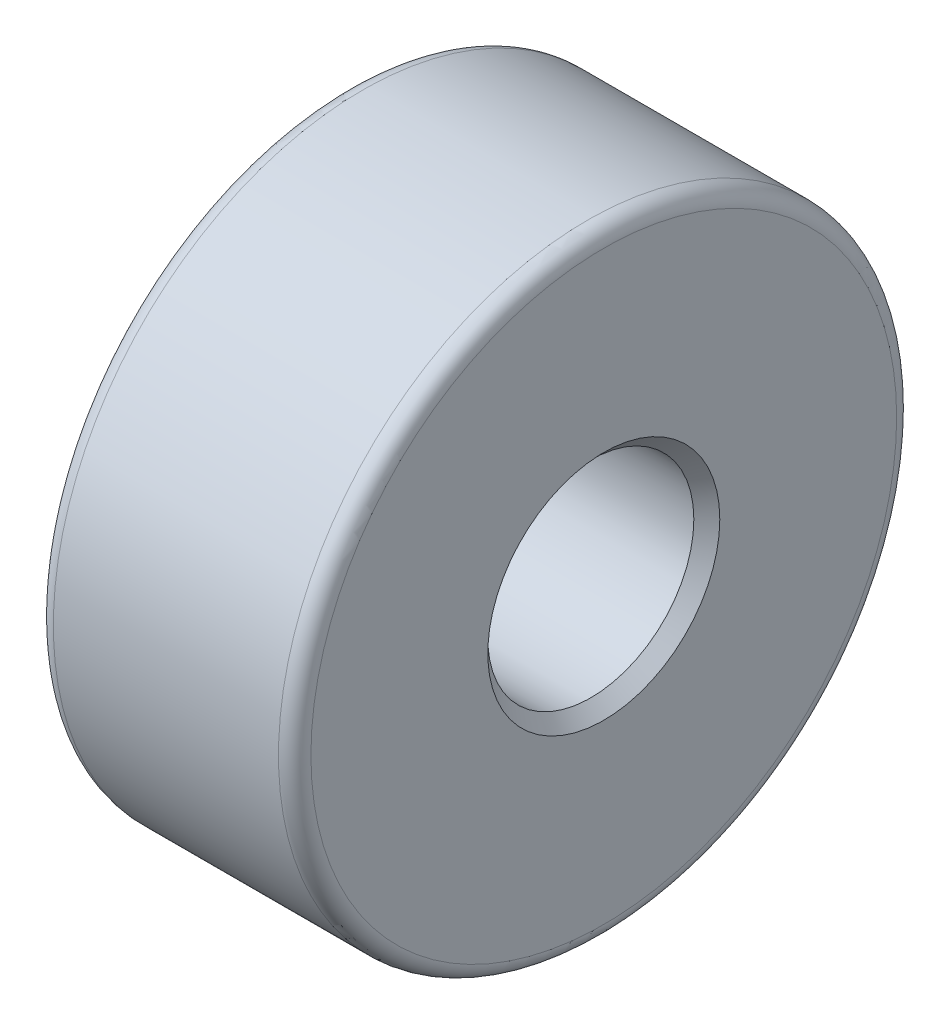
ISO-10303-21;
HEADER;
FILE_DESCRIPTION(('STEP AP214'),'2;1');
FILE_NAME('part.step','',(''),(''),'','','');
FILE_SCHEMA(('AUTOMOTIVE_DESIGN { 1 0 10303 214 1 1 1 1 }'));
ENDSEC;
DATA;
#1=APPLICATION_CONTEXT('core data for automotive mechanical design processes');
#2=APPLICATION_PROTOCOL_DEFINITION('international standard','automotive_design',2000,#1);
#3=PRODUCT_CONTEXT('',#1,'mechanical');
#4=PRODUCT('Part','Part','',(#3));
#5=PRODUCT_RELATED_PRODUCT_CATEGORY('part','',(#4));
#6=PRODUCT_DEFINITION_FORMATION('','',#4);
#7=PRODUCT_DEFINITION_CONTEXT('part definition',#1,'design');
#8=PRODUCT_DEFINITION('design','',#6,#7);
#9=PRODUCT_DEFINITION_SHAPE('','',#8);
#10=(LENGTH_UNIT() NAMED_UNIT(*) SI_UNIT(.MILLI.,.METRE.));
#11=(NAMED_UNIT(*) PLANE_ANGLE_UNIT() SI_UNIT($,.RADIAN.));
#12=(NAMED_UNIT(*) SI_UNIT($,.STERADIAN.) SOLID_ANGLE_UNIT());
#13=UNCERTAINTY_MEASURE_WITH_UNIT(LENGTH_MEASURE(1.E-05),#10,'distance_accuracy_value','');
#14=(GEOMETRIC_REPRESENTATION_CONTEXT(3) GLOBAL_UNCERTAINTY_ASSIGNED_CONTEXT((#13)) GLOBAL_UNIT_ASSIGNED_CONTEXT((#10,
#11,#12)) REPRESENTATION_CONTEXT('',''));
#15=CARTESIAN_POINT('',(0.,0.,0.));
#16=DIRECTION('',(0.,0.,1.));
#17=DIRECTION('',(1.,0.,0.));
#18=AXIS2_PLACEMENT_3D('',#15,#16,#17);
#19=CARTESIAN_POINT('',(3.96875,0.,0.));
#20=DIRECTION('',(1.,0.,0.));
#21=DIRECTION('',(0.,0.,-1.));
#22=AXIS2_PLACEMENT_3D('',#19,#20,#21);
#23=PLANE('',#22);
#24=CARTESIAN_POINT('',(3.96875,0.,0.));
#25=DIRECTION('',(1.,0.,0.));
#26=DIRECTION('',(0.,0.,-1.));
#27=AXIS2_PLACEMENT_3D('',#24,#25,#26);
#28=CIRCLE('',#27,4.5125);
#29=CARTESIAN_POINT('',(3.96875,0.,-4.5125));
#30=VERTEX_POINT('',#29);
#31=EDGE_CURVE('E55',#30,#30,#28,.T.);
#32=ORIENTED_EDGE('',*,*,#31,.T.);
#33=EDGE_LOOP('',(#32));
#34=FACE_BOUND('',#33,.T.);
#35=CARTESIAN_POINT('',(3.96875,0.,0.));
#36=DIRECTION('',(1.,0.,0.));
#37=DIRECTION('',(0.,0.,-1.));
#38=AXIS2_PLACEMENT_3D('',#35,#36,#37);
#39=CIRCLE('',#38,1.7875);
#40=CARTESIAN_POINT('',(3.96875,0.,-1.7875));
#41=VERTEX_POINT('',#40);
#42=EDGE_CURVE('E61',#41,#41,#39,.F.);
#43=ORIENTED_EDGE('',*,*,#42,.T.);
#44=EDGE_LOOP('',(#43));
#45=FACE_BOUND('',#44,.T.);
#46=ADVANCED_FACE('F37',(#34,#45),#23,.T.);
#47=CARTESIAN_POINT('',(0.,0.,0.));
#48=DIRECTION('',(1.,0.,0.));
#49=DIRECTION('',(0.,0.,-1.));
#50=AXIS2_PLACEMENT_3D('',#47,#48,#49);
#51=PLANE('',#50);
#52=CARTESIAN_POINT('',(0.,0.,0.));
#53=DIRECTION('',(1.,0.,0.));
#54=DIRECTION('',(0.,0.,-1.));
#55=AXIS2_PLACEMENT_3D('',#52,#53,#54);
#56=CIRCLE('',#55,4.5125);
#57=CARTESIAN_POINT('',(0.,0.,-4.5125));
#58=VERTEX_POINT('',#57);
#59=EDGE_CURVE('E10',#58,#58,#56,.F.);
#60=ORIENTED_EDGE('',*,*,#59,.T.);
#61=EDGE_LOOP('',(#60));
#62=FACE_BOUND('',#61,.T.);
#63=CARTESIAN_POINT('',(0.,0.,0.));
#64=DIRECTION('',(1.,0.,0.));
#65=DIRECTION('',(0.,0.,-1.));
#66=AXIS2_PLACEMENT_3D('',#63,#64,#65);
#67=CIRCLE('',#66,1.7875);
#68=CARTESIAN_POINT('',(0.,0.,-1.7875));
#69=VERTEX_POINT('',#68);
#70=EDGE_CURVE('E73',#69,#69,#67,.T.);
#71=ORIENTED_EDGE('',*,*,#70,.T.);
#72=EDGE_LOOP('',(#71));
#73=FACE_BOUND('',#72,.T.);
#74=ADVANCED_FACE('F78',(#62,#73),#51,.F.);
#75=CARTESIAN_POINT('',(3.96875,0.,0.));
#76=DIRECTION('',(-1.,0.,0.));
#77=DIRECTION('',(0.,0.,1.));
#78=AXIS2_PLACEMENT_3D('',#75,#76,#77);
#79=CYLINDRICAL_SURFACE('',#78,4.7625);
#80=CARTESIAN_POINT('',(3.71875,0.,0.));
#81=DIRECTION('',(1.,0.,0.));
#82=DIRECTION('',(0.,0.,-1.));
#83=AXIS2_PLACEMENT_3D('',#80,#81,#82);
#84=CIRCLE('',#83,4.7625);
#85=CARTESIAN_POINT('',(3.71875,0.,-4.7625));
#86=VERTEX_POINT('',#85);
#87=EDGE_CURVE('E45',#86,#86,#84,.F.);
#88=ORIENTED_EDGE('',*,*,#87,.T.);
#89=EDGE_LOOP('',(#88));
#90=FACE_BOUND('',#89,.T.);
#91=CARTESIAN_POINT('',(0.25,0.,0.));
#92=DIRECTION('',(1.,0.,0.));
#93=DIRECTION('',(0.,0.,-1.));
#94=AXIS2_PLACEMENT_3D('',#91,#92,#93);
#95=CIRCLE('',#94,4.7625);
#96=CARTESIAN_POINT('',(0.25,0.,-4.7625));
#97=VERTEX_POINT('',#96);
#98=EDGE_CURVE('E50',#97,#97,#95,.T.);
#99=ORIENTED_EDGE('',*,*,#98,.T.);
#100=EDGE_LOOP('',(#99));
#101=FACE_BOUND('',#100,.T.);
#102=ADVANCED_FACE('F93',(#90,#101),#79,.T.);
#103=CARTESIAN_POINT('',(3.96875,0.,0.));
#104=DIRECTION('',(-1.,0.,0.));
#105=DIRECTION('',(0.,0.,1.));
#106=AXIS2_PLACEMENT_3D('',#103,#104,#105);
#107=CYLINDRICAL_SURFACE('',#106,1.5875);
#108=CARTESIAN_POINT('',(0.200000000000003,0.,0.));
#109=DIRECTION('',(1.,0.,0.));
#110=DIRECTION('',(0.,0.,-1.));
#111=AXIS2_PLACEMENT_3D('',#108,#109,#110);
#112=CIRCLE('',#111,1.5875);
#113=CARTESIAN_POINT('',(0.200000000000003,0.,-1.5875));
#114=VERTEX_POINT('',#113);
#115=EDGE_CURVE('E65',#114,#114,#112,.F.);
#116=ORIENTED_EDGE('',*,*,#115,.T.);
#117=EDGE_LOOP('',(#116));
#118=FACE_BOUND('',#117,.T.);
#119=CARTESIAN_POINT('',(3.76875,0.,0.));
#120=DIRECTION('',(1.,0.,0.));
#121=DIRECTION('',(0.,0.,-1.));
#122=AXIS2_PLACEMENT_3D('',#119,#120,#121);
#123=CIRCLE('',#122,1.5875);
#124=CARTESIAN_POINT('',(3.76875,0.,-1.5875));
#125=VERTEX_POINT('',#124);
#126=EDGE_CURVE('E69',#125,#125,#123,.T.);
#127=ORIENTED_EDGE('',*,*,#126,.T.);
#128=EDGE_LOOP('',(#127));
#129=FACE_BOUND('',#128,.T.);
#130=ADVANCED_FACE('F83',(#118,#129),#107,.F.);
#131=CARTESIAN_POINT('',(0.,0.,0.));
#132=DIRECTION('',(-1.,0.,0.));
#133=DIRECTION('',(0.,0.,1.));
#134=AXIS2_PLACEMENT_3D('',#131,#132,#133);
#135=CONICAL_SURFACE('',#134,1.7875,0.785398163397443);
#136=ORIENTED_EDGE('',*,*,#115,.F.);
#137=EDGE_LOOP('',(#136));
#138=FACE_BOUND('',#137,.T.);
#139=ORIENTED_EDGE('',*,*,#70,.F.);
#140=EDGE_LOOP('',(#139));
#141=FACE_BOUND('',#140,.T.);
#142=ADVANCED_FACE('F80',(#138,#141),#135,.F.);
#143=CARTESIAN_POINT('',(3.76875,0.,0.));
#144=DIRECTION('',(1.,0.,0.));
#145=DIRECTION('',(0.,0.,-1.));
#146=AXIS2_PLACEMENT_3D('',#143,#144,#145);
#147=CONICAL_SURFACE('',#146,1.5875,0.785398163397453);
#148=ORIENTED_EDGE('',*,*,#42,.F.);
#149=EDGE_LOOP('',(#148));
#150=FACE_BOUND('',#149,.T.);
#151=ORIENTED_EDGE('',*,*,#126,.F.);
#152=EDGE_LOOP('',(#151));
#153=FACE_BOUND('',#152,.T.);
#154=ADVANCED_FACE('F82',(#150,#153),#147,.F.);
#155=CARTESIAN_POINT('',(3.71875,0.,0.));
#156=DIRECTION('',(1.,0.,0.));
#157=DIRECTION('',(0.,0.,-1.));
#158=AXIS2_PLACEMENT_3D('',#155,#156,#157);
#159=TOROIDAL_SURFACE('',#158,4.5125,0.25);
#160=ORIENTED_EDGE('',*,*,#87,.F.);
#161=EDGE_LOOP('',(#160));
#162=FACE_BOUND('',#161,.T.);
#163=ORIENTED_EDGE('',*,*,#31,.F.);
#164=EDGE_LOOP('',(#163));
#165=FACE_BOUND('',#164,.T.);
#166=ADVANCED_FACE('F90',(#162,#165),#159,.T.);
#167=CARTESIAN_POINT('',(0.25,0.,0.));
#168=DIRECTION('',(1.,0.,0.));
#169=DIRECTION('',(0.,0.,-1.));
#170=AXIS2_PLACEMENT_3D('',#167,#168,#169);
#171=TOROIDAL_SURFACE('',#170,4.5125,0.25);
#172=ORIENTED_EDGE('',*,*,#59,.F.);
#173=EDGE_LOOP('',(#172));
#174=FACE_BOUND('',#173,.T.);
#175=ORIENTED_EDGE('',*,*,#98,.F.);
#176=EDGE_LOOP('',(#175));
#177=FACE_BOUND('',#176,.T.);
#178=ADVANCED_FACE('F39',(#174,#177),#171,.T.);
#179=CLOSED_SHELL('',(#46,#74,#102,#130,#142,#154,#166,#178));
#180=MANIFOLD_SOLID_BREP('B2',#179);
#181=ADVANCED_BREP_SHAPE_REPRESENTATION('',(#18,#180),#14);
#182=SHAPE_DEFINITION_REPRESENTATION(#9,#181);
ENDSEC;
END-ISO-10303-21;
